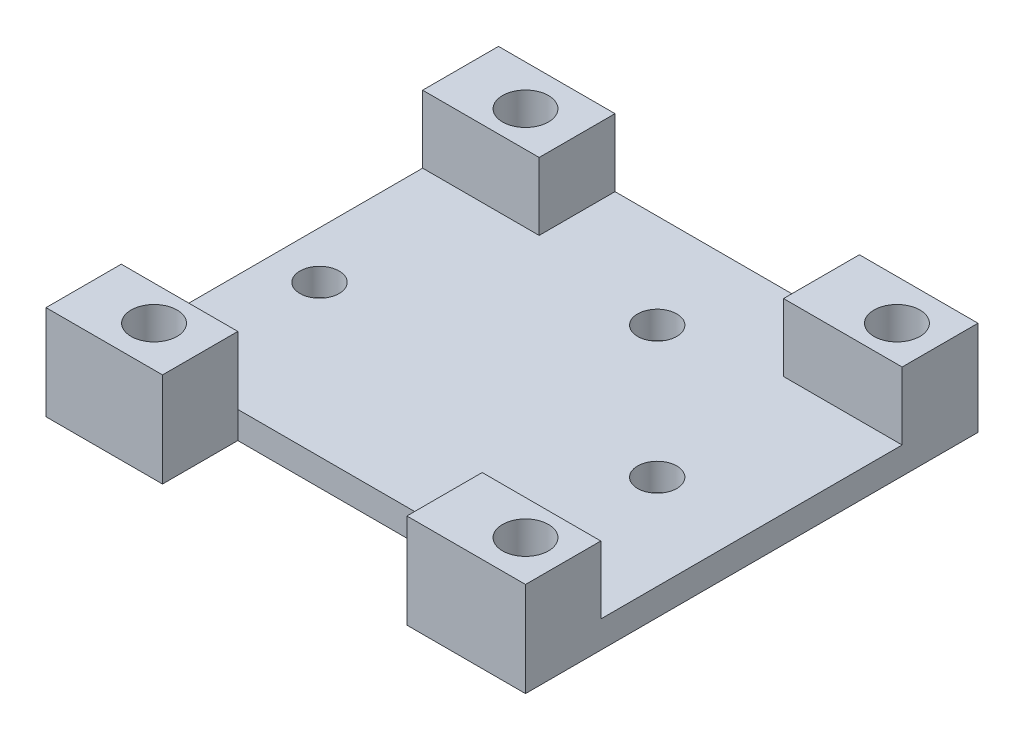
ISO-10303-21;
HEADER;
FILE_DESCRIPTION(('STEP AP214'),'2;1');
FILE_NAME('part.step','',(''),(''),'','','');
FILE_SCHEMA(('AUTOMOTIVE_DESIGN { 1 0 10303 214 1 1 1 1 }'));
ENDSEC;
DATA;
#1=APPLICATION_CONTEXT('core data for automotive mechanical design processes');
#2=APPLICATION_PROTOCOL_DEFINITION('international standard','automotive_design',2000,#1);
#3=PRODUCT_CONTEXT('',#1,'mechanical');
#4=PRODUCT('Part','Part','',(#3));
#5=PRODUCT_RELATED_PRODUCT_CATEGORY('part','',(#4));
#6=PRODUCT_DEFINITION_FORMATION('','',#4);
#7=PRODUCT_DEFINITION_CONTEXT('part definition',#1,'design');
#8=PRODUCT_DEFINITION('design','',#6,#7);
#9=PRODUCT_DEFINITION_SHAPE('','',#8);
#10=(LENGTH_UNIT() NAMED_UNIT(*) SI_UNIT(.MILLI.,.METRE.));
#11=(NAMED_UNIT(*) PLANE_ANGLE_UNIT() SI_UNIT($,.RADIAN.));
#12=(NAMED_UNIT(*) SI_UNIT($,.STERADIAN.) SOLID_ANGLE_UNIT());
#13=UNCERTAINTY_MEASURE_WITH_UNIT(LENGTH_MEASURE(1.E-05),#10,'distance_accuracy_value','');
#14=(GEOMETRIC_REPRESENTATION_CONTEXT(3) GLOBAL_UNCERTAINTY_ASSIGNED_CONTEXT((#13)) GLOBAL_UNIT_ASSIGNED_CONTEXT((#10,
#11,#12)) REPRESENTATION_CONTEXT('',''));
#15=CARTESIAN_POINT('',(0.,0.,0.));
#16=DIRECTION('',(0.,0.,1.));
#17=DIRECTION('',(1.,0.,0.));
#18=AXIS2_PLACEMENT_3D('',#15,#16,#17);
#19=CARTESIAN_POINT('',(0.,2.,0.));
#20=DIRECTION('',(0.,1.,0.));
#21=DIRECTION('',(0.,0.,1.));
#22=AXIS2_PLACEMENT_3D('',#19,#20,#21);
#23=PLANE('',#22);
#24=DIRECTION('',(0.,0.,-1.));
#25=VECTOR('',#24,1.);
#26=CARTESIAN_POINT('',(-15.5,2.,0.));
#27=LINE('',#26,#25);
#28=CARTESIAN_POINT('',(-15.5,2.,11.1762712747934));
#29=VERTEX_POINT('',#28);
#30=CARTESIAN_POINT('',(-15.5,2.,-11.1332856160443));
#31=VERTEX_POINT('',#30);
#32=EDGE_CURVE('E351',#29,#31,#27,.T.);
#33=ORIENTED_EDGE('',*,*,#32,.F.);
#34=DIRECTION('',(1.,0.,0.));
#35=VECTOR('',#34,1.);
#36=CARTESIAN_POINT('',(-20.,2.,11.1762712747934));
#37=LINE('',#36,#35);
#38=CARTESIAN_POINT('',(-6.87255590859099,2.,11.1762712747934));
#39=VERTEX_POINT('',#38);
#40=EDGE_CURVE('E205',#29,#39,#37,.T.);
#41=ORIENTED_EDGE('',*,*,#40,.T.);
#42=CARTESIAN_POINT('',(11.2192569335427,2.,11.1762712747934));
#43=VERTEX_POINT('',#42);
#44=EDGE_CURVE('E193',#39,#43,#37,.T.);
#45=ORIENTED_EDGE('',*,*,#44,.T.);
#46=CARTESIAN_POINT('',(20.,2.,11.1762712747934));
#47=VERTEX_POINT('',#46);
#48=EDGE_CURVE('E202',#43,#47,#37,.T.);
#49=ORIENTED_EDGE('',*,*,#48,.T.);
#50=DIRECTION('',(0.,0.,-1.));
#51=VECTOR('',#50,1.);
#52=CARTESIAN_POINT('',(20.,2.,-11.1332856160443));
#53=LINE('',#52,#51);
#54=CARTESIAN_POINT('',(20.,2.,-11.1332856160443));
#55=VERTEX_POINT('',#54);
#56=EDGE_CURVE('E257',#47,#55,#53,.T.);
#57=ORIENTED_EDGE('',*,*,#56,.T.);
#58=DIRECTION('',(-1.,0.,0.));
#59=VECTOR('',#58,1.);
#60=CARTESIAN_POINT('',(11.2192569335427,2.,-11.1332856160443));
#61=LINE('',#60,#59);
#62=CARTESIAN_POINT('',(11.2192569335427,2.,-11.1332856160443));
#63=VERTEX_POINT('',#62);
#64=EDGE_CURVE('E260',#55,#63,#61,.T.);
#65=ORIENTED_EDGE('',*,*,#64,.T.);
#66=DIRECTION('',(0.,0.,-1.));
#67=VECTOR('',#66,1.);
#68=CARTESIAN_POINT('',(11.2192569335427,2.,-16.75));
#69=LINE('',#68,#67);
#70=CARTESIAN_POINT('',(11.2192569335427,2.,-16.75));
#71=VERTEX_POINT('',#70);
#72=EDGE_CURVE('E207',#63,#71,#69,.T.);
#73=ORIENTED_EDGE('',*,*,#72,.T.);
#74=DIRECTION('',(-1.,0.,0.));
#75=VECTOR('',#74,1.);
#76=CARTESIAN_POINT('',(-20.,2.,-16.75));
#77=LINE('',#76,#75);
#78=CARTESIAN_POINT('',(-6.87255590859099,2.,-16.75));
#79=VERTEX_POINT('',#78);
#80=EDGE_CURVE('E214',#71,#79,#77,.T.);
#81=ORIENTED_EDGE('',*,*,#80,.T.);
#82=DIRECTION('',(0.,0.,-1.));
#83=VECTOR('',#82,1.);
#84=CARTESIAN_POINT('',(-6.87255590859099,2.,-16.75));
#85=LINE('',#84,#83);
#86=CARTESIAN_POINT('',(-6.87255590859099,2.,-11.1332856160443));
#87=VERTEX_POINT('',#86);
#88=EDGE_CURVE('E327',#87,#79,#85,.T.);
#89=ORIENTED_EDGE('',*,*,#88,.F.);
#90=DIRECTION('',(1.,0.,0.));
#91=VECTOR('',#90,1.);
#92=CARTESIAN_POINT('',(-6.87255590859099,2.,-11.1332856160443));
#93=LINE('',#92,#91);
#94=EDGE_CURVE('E324',#31,#87,#93,.T.);
#95=ORIENTED_EDGE('',*,*,#94,.F.);
#96=EDGE_LOOP('',(#33,#41,#45,#49,#57,#65,#73,#81,#89,#95));
#97=FACE_BOUND('',#96,.T.);
#98=CARTESIAN_POINT('',(3.25,2.,-9.75000000000001));
#99=DIRECTION('',(0.,1.,0.));
#100=DIRECTION('',(0.,0.,1.));
#101=AXIS2_PLACEMENT_3D('',#98,#99,#100);
#102=CIRCLE('',#101,1.44999999999999);
#103=CARTESIAN_POINT('',(3.25,2.,-8.30000000000002));
#104=VERTEX_POINT('',#103);
#105=EDGE_CURVE('E269',#104,#104,#102,.T.);
#106=ORIENTED_EDGE('',*,*,#105,.F.);
#107=EDGE_LOOP('',(#106));
#108=FACE_BOUND('',#107,.T.);
#109=CARTESIAN_POINT('',(13.,2.,0.));
#110=DIRECTION('',(0.,1.,0.));
#111=DIRECTION('',(0.,0.,1.));
#112=AXIS2_PLACEMENT_3D('',#109,#110,#111);
#113=CIRCLE('',#112,1.44999999999999);
#114=CARTESIAN_POINT('',(13.,2.,1.44999999999998));
#115=VERTEX_POINT('',#114);
#116=EDGE_CURVE('E278',#115,#115,#113,.T.);
#117=ORIENTED_EDGE('',*,*,#116,.F.);
#118=EDGE_LOOP('',(#117));
#119=FACE_BOUND('',#118,.T.);
#120=CARTESIAN_POINT('',(-12.,2.,0.));
#121=DIRECTION('',(0.,1.,0.));
#122=DIRECTION('',(0.,0.,1.));
#123=AXIS2_PLACEMENT_3D('',#120,#121,#122);
#124=CIRCLE('',#123,1.44999999999999);
#125=CARTESIAN_POINT('',(-12.,2.,1.44999999999998));
#126=VERTEX_POINT('',#125);
#127=EDGE_CURVE('E284',#126,#126,#124,.T.);
#128=ORIENTED_EDGE('',*,*,#127,.F.);
#129=EDGE_LOOP('',(#128));
#130=FACE_BOUND('',#129,.T.);
#131=ADVANCED_FACE('F34',(#97,#108,#119,#130),#23,.T.);
#132=CARTESIAN_POINT('',(0.,7.,0.));
#133=DIRECTION('',(0.,1.,0.));
#134=DIRECTION('',(0.,0.,1.));
#135=AXIS2_PLACEMENT_3D('',#132,#133,#134);
#136=PLANE('',#135);
#137=DIRECTION('',(-1.,0.,0.));
#138=VECTOR('',#137,1.);
#139=CARTESIAN_POINT('',(11.2192569335427,7.,-11.1332856160443));
#140=LINE('',#139,#138);
#141=CARTESIAN_POINT('',(20.,7.,-11.1332856160443));
#142=VERTEX_POINT('',#141);
#143=CARTESIAN_POINT('',(11.2192569335427,7.,-11.1332856160443));
#144=VERTEX_POINT('',#143);
#145=EDGE_CURVE('E255',#142,#144,#140,.T.);
#146=ORIENTED_EDGE('',*,*,#145,.F.);
#147=DIRECTION('',(0.,0.,-1.));
#148=VECTOR('',#147,1.);
#149=CARTESIAN_POINT('',(20.,7.,-16.75));
#150=LINE('',#149,#148);
#151=CARTESIAN_POINT('',(20.,7.,-16.75));
#152=VERTEX_POINT('',#151);
#153=EDGE_CURVE('E175',#142,#152,#150,.T.);
#154=ORIENTED_EDGE('',*,*,#153,.T.);
#155=DIRECTION('',(-1.,0.,0.));
#156=VECTOR('',#155,1.);
#157=CARTESIAN_POINT('',(-20.,7.,-16.75));
#158=LINE('',#157,#156);
#159=CARTESIAN_POINT('',(11.2192569335427,7.,-16.75));
#160=VERTEX_POINT('',#159);
#161=EDGE_CURVE('E178',#152,#160,#158,.T.);
#162=ORIENTED_EDGE('',*,*,#161,.T.);
#163=DIRECTION('',(0.,0.,-1.));
#164=VECTOR('',#163,1.);
#165=CARTESIAN_POINT('',(11.2192569335427,7.,-16.75));
#166=LINE('',#165,#164);
#167=EDGE_CURVE('E208',#144,#160,#166,.T.);
#168=ORIENTED_EDGE('',*,*,#167,.F.);
#169=EDGE_LOOP('',(#146,#154,#162,#168));
#170=FACE_BOUND('',#169,.T.);
#171=CARTESIAN_POINT('',(17.,7.,-13.75));
#172=DIRECTION('',(0.,1.,0.));
#173=DIRECTION('',(0.,0.,1.));
#174=AXIS2_PLACEMENT_3D('',#171,#172,#173);
#175=CIRCLE('',#174,1.69999999999999);
#176=CARTESIAN_POINT('',(17.,7.,-12.05));
#177=VERTEX_POINT('',#176);
#178=EDGE_CURVE('E230',#177,#177,#175,.T.);
#179=ORIENTED_EDGE('',*,*,#178,.F.);
#180=EDGE_LOOP('',(#179));
#181=FACE_BOUND('',#180,.T.);
#182=ADVANCED_FACE('F253',(#170,#181),#136,.T.);
#183=CARTESIAN_POINT('',(20.,7.,-16.75));
#184=DIRECTION('',(-1.,0.,0.));
#185=DIRECTION('',(0.,0.,1.));
#186=AXIS2_PLACEMENT_3D('',#183,#184,#185);
#187=PLANE('',#186);
#188=ORIENTED_EDGE('',*,*,#56,.F.);
#189=DIRECTION('',(0.,-1.,0.));
#190=VECTOR('',#189,1.);
#191=CARTESIAN_POINT('',(20.,7.,11.1762712747934));
#192=LINE('',#191,#190);
#193=CARTESIAN_POINT('',(20.,7.,11.1762712747934));
#194=VERTEX_POINT('',#193);
#195=EDGE_CURVE('E300',#194,#47,#192,.T.);
#196=ORIENTED_EDGE('',*,*,#195,.F.);
#197=DIRECTION('',(0.,0.,1.));
#198=VECTOR('',#197,1.);
#199=CARTESIAN_POINT('',(20.,7.,11.1762712747934));
#200=LINE('',#199,#198);
#201=CARTESIAN_POINT('',(20.,7.,16.75));
#202=VERTEX_POINT('',#201);
#203=EDGE_CURVE('E312',#194,#202,#200,.T.);
#204=ORIENTED_EDGE('',*,*,#203,.T.);
#205=DIRECTION('',(0.,-1.,0.));
#206=VECTOR('',#205,1.);
#207=CARTESIAN_POINT('',(20.,7.,16.75));
#208=LINE('',#207,#206);
#209=CARTESIAN_POINT('',(20.,0.,16.75));
#210=VERTEX_POINT('',#209);
#211=EDGE_CURVE('E243',#202,#210,#208,.T.);
#212=ORIENTED_EDGE('',*,*,#211,.T.);
#213=DIRECTION('',(0.,0.,-1.));
#214=VECTOR('',#213,1.);
#215=CARTESIAN_POINT('',(20.,0.,-16.75));
#216=LINE('',#215,#214);
#217=CARTESIAN_POINT('',(20.,0.,-16.75));
#218=VERTEX_POINT('',#217);
#219=EDGE_CURVE('E180',#210,#218,#216,.T.);
#220=ORIENTED_EDGE('',*,*,#219,.T.);
#221=DIRECTION('',(0.,-1.,0.));
#222=VECTOR('',#221,1.);
#223=CARTESIAN_POINT('',(20.,7.,-16.75));
#224=LINE('',#223,#222);
#225=EDGE_CURVE('E184',#152,#218,#224,.T.);
#226=ORIENTED_EDGE('',*,*,#225,.F.);
#227=ORIENTED_EDGE('',*,*,#153,.F.);
#228=DIRECTION('',(0.,1.,0.));
#229=VECTOR('',#228,1.);
#230=CARTESIAN_POINT('',(20.,2.,-11.1332856160443));
#231=LINE('',#230,#229);
#232=EDGE_CURVE('E211',#55,#142,#231,.T.);
#233=ORIENTED_EDGE('',*,*,#232,.F.);
#234=EDGE_LOOP('',(#188,#196,#204,#212,#220,#226,#227,#233));
#235=FACE_BOUND('',#234,.T.);
#236=ADVANCED_FACE('F36',(#235),#187,.F.);
#237=CARTESIAN_POINT('',(-20.,7.,-16.75));
#238=DIRECTION('',(0.,0.,1.));
#239=DIRECTION('',(1.,0.,0.));
#240=AXIS2_PLACEMENT_3D('',#237,#238,#239);
#241=PLANE('',#240);
#242=DIRECTION('',(-1.,0.,0.));
#243=VECTOR('',#242,1.);
#244=CARTESIAN_POINT('',(-20.,0.,-16.75));
#245=LINE('',#244,#243);
#246=CARTESIAN_POINT('',(-15.5,0.,-16.75));
#247=VERTEX_POINT('',#246);
#248=EDGE_CURVE('E176',#218,#247,#245,.T.);
#249=ORIENTED_EDGE('',*,*,#248,.T.);
#250=DIRECTION('',(0.,1.,0.));
#251=VECTOR('',#250,1.);
#252=CARTESIAN_POINT('',(-15.5,0.,-16.75));
#253=LINE('',#252,#251);
#254=CARTESIAN_POINT('',(-15.5,7.,-16.75));
#255=VERTEX_POINT('',#254);
#256=EDGE_CURVE('E157',#247,#255,#253,.T.);
#257=ORIENTED_EDGE('',*,*,#256,.T.);
#258=DIRECTION('',(-1.,0.,0.));
#259=VECTOR('',#258,1.);
#260=CARTESIAN_POINT('',(-6.87255590859099,7.,-16.75));
#261=LINE('',#260,#259);
#262=CARTESIAN_POINT('',(-6.87255590859099,7.,-16.75));
#263=VERTEX_POINT('',#262);
#264=EDGE_CURVE('E332',#263,#255,#261,.T.);
#265=ORIENTED_EDGE('',*,*,#264,.F.);
#266=DIRECTION('',(0.,-1.,0.));
#267=VECTOR('',#266,1.);
#268=CARTESIAN_POINT('',(-6.87255590859099,7.,-16.75));
#269=LINE('',#268,#267);
#270=EDGE_CURVE('E309',#263,#79,#269,.T.);
#271=ORIENTED_EDGE('',*,*,#270,.T.);
#272=ORIENTED_EDGE('',*,*,#80,.F.);
#273=DIRECTION('',(0.,1.,0.));
#274=VECTOR('',#273,1.);
#275=CARTESIAN_POINT('',(11.2192569335427,2.,-16.75));
#276=LINE('',#275,#274);
#277=EDGE_CURVE('E217',#71,#160,#276,.T.);
#278=ORIENTED_EDGE('',*,*,#277,.T.);
#279=ORIENTED_EDGE('',*,*,#161,.F.);
#280=ORIENTED_EDGE('',*,*,#225,.T.);
#281=EDGE_LOOP('',(#249,#257,#265,#271,#272,#278,#279,#280));
#282=FACE_BOUND('',#281,.T.);
#283=ADVANCED_FACE('F247',(#282),#241,.F.);
#284=CARTESIAN_POINT('',(-20.,7.,16.75));
#285=DIRECTION('',(0.,0.,-1.));
#286=DIRECTION('',(-1.,0.,0.));
#287=AXIS2_PLACEMENT_3D('',#284,#285,#286);
#288=PLANE('',#287);
#289=DIRECTION('',(1.,0.,0.));
#290=VECTOR('',#289,1.);
#291=CARTESIAN_POINT('',(-20.,7.,16.75));
#292=LINE('',#291,#290);
#293=CARTESIAN_POINT('',(-15.5,7.,16.75));
#294=VERTEX_POINT('',#293);
#295=CARTESIAN_POINT('',(-6.87255590859099,7.,16.75));
#296=VERTEX_POINT('',#295);
#297=EDGE_CURVE('E169',#294,#296,#292,.T.);
#298=ORIENTED_EDGE('',*,*,#297,.F.);
#299=DIRECTION('',(0.,1.,0.));
#300=VECTOR('',#299,1.);
#301=CARTESIAN_POINT('',(-15.5,0.,16.75));
#302=LINE('',#301,#300);
#303=CARTESIAN_POINT('',(-15.5,0.,16.75));
#304=VERTEX_POINT('',#303);
#305=EDGE_CURVE('E154',#304,#294,#302,.T.);
#306=ORIENTED_EDGE('',*,*,#305,.F.);
#307=DIRECTION('',(1.,0.,0.));
#308=VECTOR('',#307,1.);
#309=CARTESIAN_POINT('',(-20.,0.,16.75));
#310=LINE('',#309,#308);
#311=CARTESIAN_POINT('',(-6.87255590859099,0.,16.75));
#312=VERTEX_POINT('',#311);
#313=EDGE_CURVE('E167',#304,#312,#310,.T.);
#314=ORIENTED_EDGE('',*,*,#313,.T.);
#315=DIRECTION('',(0.,1.,0.));
#316=VECTOR('',#315,1.);
#317=CARTESIAN_POINT('',(-6.87255590859099,0.,16.75));
#318=LINE('',#317,#316);
#319=EDGE_CURVE('E288',#312,#296,#318,.T.);
#320=ORIENTED_EDGE('',*,*,#319,.T.);
#321=EDGE_LOOP('',(#298,#306,#314,#320));
#322=FACE_BOUND('',#321,.T.);
#323=ADVANCED_FACE('F165',(#322),#288,.F.);
#324=DIRECTION('',(0.,0.,-1.));
#325=VECTOR('',#324,1.);
#326=CARTESIAN_POINT('',(-15.5,7.,-16.75));
#327=LINE('',#326,#325);
#328=CARTESIAN_POINT('',(-15.5,7.,11.1762712747934));
#329=VERTEX_POINT('',#328);
#330=EDGE_CURVE('E161',#294,#329,#327,.T.);
#331=ORIENTED_EDGE('',*,*,#330,.F.);
#332=ORIENTED_EDGE('',*,*,#297,.T.);
#333=DIRECTION('',(0.,0.,1.));
#334=VECTOR('',#333,1.);
#335=CARTESIAN_POINT('',(-6.87255590859099,7.,11.1762712747934));
#336=LINE('',#335,#334);
#337=CARTESIAN_POINT('',(-6.87255590859099,7.,11.1762712747934));
#338=VERTEX_POINT('',#337);
#339=EDGE_CURVE('E292',#338,#296,#336,.T.);
#340=ORIENTED_EDGE('',*,*,#339,.F.);
#341=DIRECTION('',(1.,0.,0.));
#342=VECTOR('',#341,1.);
#343=CARTESIAN_POINT('',(-20.,7.,11.1762712747934));
#344=LINE('',#343,#342);
#345=EDGE_CURVE('E218',#329,#338,#344,.T.);
#346=ORIENTED_EDGE('',*,*,#345,.F.);
#347=EDGE_LOOP('',(#331,#332,#340,#346));
#348=FACE_BOUND('',#347,.T.);
#349=CARTESIAN_POINT('',(-10.5,7.,13.75));
#350=DIRECTION('',(0.,1.,0.));
#351=DIRECTION('',(0.,0.,1.));
#352=AXIS2_PLACEMENT_3D('',#349,#350,#351);
#353=CIRCLE('',#352,1.69999999999999);
#354=CARTESIAN_POINT('',(-10.5,7.,15.45));
#355=VERTEX_POINT('',#354);
#356=EDGE_CURVE('E224',#355,#355,#353,.T.);
#357=ORIENTED_EDGE('',*,*,#356,.F.);
#358=EDGE_LOOP('',(#357));
#359=FACE_BOUND('',#358,.T.);
#360=ADVANCED_FACE('F362',(#348,#359),#136,.T.);
#361=CARTESIAN_POINT('',(0.,0.,0.));
#362=DIRECTION('',(0.,1.,0.));
#363=DIRECTION('',(0.,0.,1.));
#364=AXIS2_PLACEMENT_3D('',#361,#362,#363);
#365=PLANE('',#364);
#366=CARTESIAN_POINT('',(-10.5,0.,-13.75));
#367=DIRECTION('',(0.,1.,0.));
#368=DIRECTION('',(0.,0.,1.));
#369=AXIS2_PLACEMENT_3D('',#366,#367,#368);
#370=CIRCLE('',#369,1.69999999999999);
#371=CARTESIAN_POINT('',(-10.5,0.,-12.05));
#372=VERTEX_POINT('',#371);
#373=EDGE_CURVE('E342',#372,#372,#370,.T.);
#374=ORIENTED_EDGE('',*,*,#373,.T.);
#375=EDGE_LOOP('',(#374));
#376=FACE_BOUND('',#375,.T.);
#377=CARTESIAN_POINT('',(17.,0.,13.75));
#378=DIRECTION('',(0.,1.,0.));
#379=DIRECTION('',(0.,0.,1.));
#380=AXIS2_PLACEMENT_3D('',#377,#378,#379);
#381=CIRCLE('',#380,1.69999999999999);
#382=CARTESIAN_POINT('',(17.,0.,15.45));
#383=VERTEX_POINT('',#382);
#384=EDGE_CURVE('E330',#383,#383,#381,.T.);
#385=ORIENTED_EDGE('',*,*,#384,.T.);
#386=EDGE_LOOP('',(#385));
#387=FACE_BOUND('',#386,.T.);
#388=CARTESIAN_POINT('',(-12.,0.,0.));
#389=DIRECTION('',(0.,1.,0.));
#390=DIRECTION('',(0.,0.,1.));
#391=AXIS2_PLACEMENT_3D('',#388,#389,#390);
#392=CIRCLE('',#391,1.45);
#393=CARTESIAN_POINT('',(-12.,0.,1.44999999999999));
#394=VERTEX_POINT('',#393);
#395=EDGE_CURVE('E281',#394,#394,#392,.T.);
#396=ORIENTED_EDGE('',*,*,#395,.T.);
#397=EDGE_LOOP('',(#396));
#398=FACE_BOUND('',#397,.T.);
#399=CARTESIAN_POINT('',(13.,0.,0.));
#400=DIRECTION('',(0.,1.,0.));
#401=DIRECTION('',(0.,0.,1.));
#402=AXIS2_PLACEMENT_3D('',#399,#400,#401);
#403=CIRCLE('',#402,1.45);
#404=CARTESIAN_POINT('',(13.,0.,1.44999999999999));
#405=VERTEX_POINT('',#404);
#406=EDGE_CURVE('E273',#405,#405,#403,.T.);
#407=ORIENTED_EDGE('',*,*,#406,.T.);
#408=EDGE_LOOP('',(#407));
#409=FACE_BOUND('',#408,.T.);
#410=CARTESIAN_POINT('',(3.25,0.,-9.75000000000001));
#411=DIRECTION('',(0.,1.,0.));
#412=DIRECTION('',(0.,0.,1.));
#413=AXIS2_PLACEMENT_3D('',#410,#411,#412);
#414=CIRCLE('',#413,1.45);
#415=CARTESIAN_POINT('',(3.25,0.,-8.30000000000001));
#416=VERTEX_POINT('',#415);
#417=EDGE_CURVE('E267',#416,#416,#414,.T.);
#418=ORIENTED_EDGE('',*,*,#417,.T.);
#419=EDGE_LOOP('',(#418));
#420=FACE_BOUND('',#419,.T.);
#421=CARTESIAN_POINT('',(-10.5,0.,13.75));
#422=DIRECTION('',(0.,1.,0.));
#423=DIRECTION('',(0.,0.,1.));
#424=AXIS2_PLACEMENT_3D('',#421,#422,#423);
#425=CIRCLE('',#424,1.69999999999999);
#426=CARTESIAN_POINT('',(-10.5,0.,15.45));
#427=VERTEX_POINT('',#426);
#428=EDGE_CURVE('E227',#427,#427,#425,.T.);
#429=ORIENTED_EDGE('',*,*,#428,.T.);
#430=EDGE_LOOP('',(#429));
#431=FACE_BOUND('',#430,.T.);
#432=CARTESIAN_POINT('',(17.,0.,-13.75));
#433=DIRECTION('',(0.,1.,0.));
#434=DIRECTION('',(0.,0.,1.));
#435=AXIS2_PLACEMENT_3D('',#432,#433,#434);
#436=CIRCLE('',#435,1.7);
#437=CARTESIAN_POINT('',(17.,0.,-12.05));
#438=VERTEX_POINT('',#437);
#439=EDGE_CURVE('E233',#438,#438,#436,.T.);
#440=ORIENTED_EDGE('',*,*,#439,.T.);
#441=EDGE_LOOP('',(#440));
#442=FACE_BOUND('',#441,.T.);
#443=ORIENTED_EDGE('',*,*,#313,.F.);
#444=DIRECTION('',(0.,0.,-1.));
#445=VECTOR('',#444,1.);
#446=CARTESIAN_POINT('',(-15.5,0.,-16.75));
#447=LINE('',#446,#445);
#448=EDGE_CURVE('E151',#304,#247,#447,.T.);
#449=ORIENTED_EDGE('',*,*,#448,.T.);
#450=ORIENTED_EDGE('',*,*,#248,.F.);
#451=ORIENTED_EDGE('',*,*,#219,.F.);
#452=DIRECTION('',(-1.,0.,0.));
#453=VECTOR('',#452,1.);
#454=CARTESIAN_POINT('',(11.2192569335427,0.,16.75));
#455=LINE('',#454,#453);
#456=CARTESIAN_POINT('',(11.2192569335427,0.,16.75));
#457=VERTEX_POINT('',#456);
#458=EDGE_CURVE('E305',#210,#457,#455,.T.);
#459=ORIENTED_EDGE('',*,*,#458,.T.);
#460=DIRECTION('',(0.,0.,-1.));
#461=VECTOR('',#460,1.);
#462=CARTESIAN_POINT('',(11.2192569335427,0.,11.1762712747934));
#463=LINE('',#462,#461);
#464=CARTESIAN_POINT('',(11.2192569335427,0.,11.1762712747934));
#465=VERTEX_POINT('',#464);
#466=EDGE_CURVE('E56',#457,#465,#463,.T.);
#467=ORIENTED_EDGE('',*,*,#466,.T.);
#468=DIRECTION('',(-1.,0.,0.));
#469=VECTOR('',#468,1.);
#470=CARTESIAN_POINT('',(-6.87255590859099,0.,11.1762712747934));
#471=LINE('',#470,#469);
#472=CARTESIAN_POINT('',(-6.87255590859099,0.,11.1762712747934));
#473=VERTEX_POINT('',#472);
#474=EDGE_CURVE('E195',#465,#473,#471,.T.);
#475=ORIENTED_EDGE('',*,*,#474,.T.);
#476=DIRECTION('',(0.,0.,1.));
#477=VECTOR('',#476,1.);
#478=CARTESIAN_POINT('',(-6.87255590859099,0.,11.1762712747934));
#479=LINE('',#478,#477);
#480=EDGE_CURVE('E174',#473,#312,#479,.T.);
#481=ORIENTED_EDGE('',*,*,#480,.T.);
#482=EDGE_LOOP('',(#443,#449,#450,#451,#459,#467,#475,#481));
#483=FACE_BOUND('',#482,.T.);
#484=ADVANCED_FACE('F172',(#376,#387,#398,#409,#420,#431,#442,#483),#365,.F.);
#485=CARTESIAN_POINT('',(17.,7.,-13.75));
#486=DIRECTION('',(0.,1.,0.));
#487=DIRECTION('',(0.,0.,1.));
#488=AXIS2_PLACEMENT_3D('',#485,#486,#487);
#489=CYLINDRICAL_SURFACE('',#488,1.69999999999999);
#490=ORIENTED_EDGE('',*,*,#439,.F.);
#491=EDGE_LOOP('',(#490));
#492=FACE_BOUND('',#491,.T.);
#493=ORIENTED_EDGE('',*,*,#178,.T.);
#494=EDGE_LOOP('',(#493));
#495=FACE_BOUND('',#494,.T.);
#496=ADVANCED_FACE('F397',(#492,#495),#489,.F.);
#497=CARTESIAN_POINT('',(-10.5,7.,13.75));
#498=DIRECTION('',(0.,1.,0.));
#499=DIRECTION('',(0.,0.,1.));
#500=AXIS2_PLACEMENT_3D('',#497,#498,#499);
#501=CYLINDRICAL_SURFACE('',#500,1.69999999999999);
#502=ORIENTED_EDGE('',*,*,#428,.F.);
#503=EDGE_LOOP('',(#502));
#504=FACE_BOUND('',#503,.T.);
#505=ORIENTED_EDGE('',*,*,#356,.T.);
#506=EDGE_LOOP('',(#505));
#507=FACE_BOUND('',#506,.T.);
#508=ADVANCED_FACE('F391',(#504,#507),#501,.F.);
#509=CARTESIAN_POINT('',(11.2192569335427,2.,-16.75));
#510=DIRECTION('',(1.,0.,0.));
#511=DIRECTION('',(0.,0.,-1.));
#512=AXIS2_PLACEMENT_3D('',#509,#510,#511);
#513=PLANE('',#512);
#514=ORIENTED_EDGE('',*,*,#72,.F.);
#515=DIRECTION('',(0.,1.,0.));
#516=VECTOR('',#515,1.);
#517=CARTESIAN_POINT('',(11.2192569335427,2.,-11.1332856160443));
#518=LINE('',#517,#516);
#519=EDGE_CURVE('E220',#63,#144,#518,.T.);
#520=ORIENTED_EDGE('',*,*,#519,.T.);
#521=ORIENTED_EDGE('',*,*,#167,.T.);
#522=ORIENTED_EDGE('',*,*,#277,.F.);
#523=EDGE_LOOP('',(#514,#520,#521,#522));
#524=FACE_BOUND('',#523,.T.);
#525=ADVANCED_FACE('F388',(#524),#513,.F.);
#526=CARTESIAN_POINT('',(-20.,2.,11.1762712747934));
#527=DIRECTION('',(0.,0.,1.));
#528=DIRECTION('',(1.,0.,0.));
#529=AXIS2_PLACEMENT_3D('',#526,#527,#528);
#530=PLANE('',#529);
#531=ORIENTED_EDGE('',*,*,#40,.F.);
#532=DIRECTION('',(0.,1.,0.));
#533=VECTOR('',#532,1.);
#534=CARTESIAN_POINT('',(-15.5,2.,11.1762712747934));
#535=LINE('',#534,#533);
#536=EDGE_CURVE('E348',#29,#329,#535,.T.);
#537=ORIENTED_EDGE('',*,*,#536,.T.);
#538=ORIENTED_EDGE('',*,*,#345,.T.);
#539=DIRECTION('',(0.,1.,0.));
#540=VECTOR('',#539,1.);
#541=CARTESIAN_POINT('',(-6.87255590859099,0.,11.1762712747934));
#542=LINE('',#541,#540);
#543=EDGE_CURVE('E290',#39,#338,#542,.T.);
#544=ORIENTED_EDGE('',*,*,#543,.F.);
#545=EDGE_LOOP('',(#531,#537,#538,#544));
#546=FACE_BOUND('',#545,.T.);
#547=ADVANCED_FACE('F358',(#546),#530,.F.);
#548=CARTESIAN_POINT('',(11.2192569335427,2.,-11.1332856160443));
#549=DIRECTION('',(0.,0.,-1.));
#550=DIRECTION('',(-1.,0.,0.));
#551=AXIS2_PLACEMENT_3D('',#548,#549,#550);
#552=PLANE('',#551);
#553=ORIENTED_EDGE('',*,*,#145,.T.);
#554=ORIENTED_EDGE('',*,*,#519,.F.);
#555=ORIENTED_EDGE('',*,*,#64,.F.);
#556=ORIENTED_EDGE('',*,*,#232,.T.);
#557=EDGE_LOOP('',(#553,#554,#555,#556));
#558=FACE_BOUND('',#557,.T.);
#559=ADVANCED_FACE('F386',(#558),#552,.F.);
#560=CARTESIAN_POINT('',(3.25,2.,-9.75000000000001));
#561=DIRECTION('',(0.,1.,0.));
#562=DIRECTION('',(0.,0.,1.));
#563=AXIS2_PLACEMENT_3D('',#560,#561,#562);
#564=CYLINDRICAL_SURFACE('',#563,1.44999999999999);
#565=ORIENTED_EDGE('',*,*,#417,.F.);
#566=EDGE_LOOP('',(#565));
#567=FACE_BOUND('',#566,.T.);
#568=ORIENTED_EDGE('',*,*,#105,.T.);
#569=EDGE_LOOP('',(#568));
#570=FACE_BOUND('',#569,.T.);
#571=ADVANCED_FACE('F440',(#567,#570),#564,.F.);
#572=CARTESIAN_POINT('',(13.,2.,0.));
#573=DIRECTION('',(0.,1.,0.));
#574=DIRECTION('',(0.,0.,1.));
#575=AXIS2_PLACEMENT_3D('',#572,#573,#574);
#576=CYLINDRICAL_SURFACE('',#575,1.44999999999999);
#577=ORIENTED_EDGE('',*,*,#406,.F.);
#578=EDGE_LOOP('',(#577));
#579=FACE_BOUND('',#578,.T.);
#580=ORIENTED_EDGE('',*,*,#116,.T.);
#581=EDGE_LOOP('',(#580));
#582=FACE_BOUND('',#581,.T.);
#583=ADVANCED_FACE('F375',(#579,#582),#576,.F.);
#584=CARTESIAN_POINT('',(-12.,2.,0.));
#585=DIRECTION('',(0.,1.,0.));
#586=DIRECTION('',(0.,0.,1.));
#587=AXIS2_PLACEMENT_3D('',#584,#585,#586);
#588=CYLINDRICAL_SURFACE('',#587,1.44999999999999);
#589=ORIENTED_EDGE('',*,*,#395,.F.);
#590=EDGE_LOOP('',(#589));
#591=FACE_BOUND('',#590,.T.);
#592=ORIENTED_EDGE('',*,*,#127,.T.);
#593=EDGE_LOOP('',(#592));
#594=FACE_BOUND('',#593,.T.);
#595=ADVANCED_FACE('F367',(#591,#594),#588,.F.);
#596=CARTESIAN_POINT('',(-6.87255590859099,0.,11.1762712747934));
#597=DIRECTION('',(-1.,0.,0.));
#598=DIRECTION('',(0.,0.,1.));
#599=AXIS2_PLACEMENT_3D('',#596,#597,#598);
#600=PLANE('',#599);
#601=ORIENTED_EDGE('',*,*,#339,.T.);
#602=ORIENTED_EDGE('',*,*,#319,.F.);
#603=ORIENTED_EDGE('',*,*,#480,.F.);
#604=EDGE_CURVE('E287',#473,#39,#542,.T.);
#605=ORIENTED_EDGE('',*,*,#604,.T.);
#606=ORIENTED_EDGE('',*,*,#543,.T.);
#607=EDGE_LOOP('',(#601,#602,#603,#605,#606));
#608=FACE_BOUND('',#607,.T.);
#609=ADVANCED_FACE('F365',(#608),#600,.F.);
#610=CARTESIAN_POINT('',(-6.87255590859099,0.,11.1762712747934));
#611=DIRECTION('',(0.,0.,-1.));
#612=DIRECTION('',(-1.,0.,0.));
#613=AXIS2_PLACEMENT_3D('',#610,#611,#612);
#614=PLANE('',#613);
#615=ORIENTED_EDGE('',*,*,#474,.F.);
#616=DIRECTION('',(0.,1.,0.));
#617=VECTOR('',#616,1.);
#618=CARTESIAN_POINT('',(11.2192569335427,0.,11.1762712747934));
#619=LINE('',#618,#617);
#620=EDGE_CURVE('E42',#465,#43,#619,.T.);
#621=ORIENTED_EDGE('',*,*,#620,.T.);
#622=ORIENTED_EDGE('',*,*,#44,.F.);
#623=ORIENTED_EDGE('',*,*,#604,.F.);
#624=EDGE_LOOP('',(#615,#621,#622,#623));
#625=FACE_BOUND('',#624,.T.);
#626=ADVANCED_FACE('F191',(#625),#614,.F.);
#627=CARTESIAN_POINT('',(11.2192569335427,7.,11.1762712747934));
#628=DIRECTION('',(-1.,0.,0.));
#629=DIRECTION('',(0.,0.,1.));
#630=AXIS2_PLACEMENT_3D('',#627,#628,#629);
#631=PLANE('',#630);
#632=ORIENTED_EDGE('',*,*,#466,.F.);
#633=DIRECTION('',(0.,-1.,0.));
#634=VECTOR('',#633,1.);
#635=CARTESIAN_POINT('',(11.2192569335427,7.,16.75));
#636=LINE('',#635,#634);
#637=CARTESIAN_POINT('',(11.2192569335427,7.,16.75));
#638=VERTEX_POINT('',#637);
#639=EDGE_CURVE('E295',#638,#457,#636,.T.);
#640=ORIENTED_EDGE('',*,*,#639,.F.);
#641=DIRECTION('',(0.,0.,-1.));
#642=VECTOR('',#641,1.);
#643=CARTESIAN_POINT('',(11.2192569335427,7.,11.1762712747934));
#644=LINE('',#643,#642);
#645=CARTESIAN_POINT('',(11.2192569335427,7.,11.1762712747934));
#646=VERTEX_POINT('',#645);
#647=EDGE_CURVE('E307',#638,#646,#644,.T.);
#648=ORIENTED_EDGE('',*,*,#647,.T.);
#649=DIRECTION('',(0.,-1.,0.));
#650=VECTOR('',#649,1.);
#651=CARTESIAN_POINT('',(11.2192569335427,7.,11.1762712747934));
#652=LINE('',#651,#650);
#653=EDGE_CURVE('E298',#646,#43,#652,.T.);
#654=ORIENTED_EDGE('',*,*,#653,.T.);
#655=ORIENTED_EDGE('',*,*,#620,.F.);
#656=EDGE_LOOP('',(#632,#640,#648,#654,#655));
#657=FACE_BOUND('',#656,.T.);
#658=ADVANCED_FACE('F373',(#657),#631,.T.);
#659=CARTESIAN_POINT('',(11.2192569335427,7.,16.75));
#660=DIRECTION('',(0.,0.,1.));
#661=DIRECTION('',(1.,0.,0.));
#662=AXIS2_PLACEMENT_3D('',#659,#660,#661);
#663=PLANE('',#662);
#664=ORIENTED_EDGE('',*,*,#458,.F.);
#665=ORIENTED_EDGE('',*,*,#211,.F.);
#666=DIRECTION('',(-1.,0.,0.));
#667=VECTOR('',#666,1.);
#668=CARTESIAN_POINT('',(11.2192569335427,7.,16.75));
#669=LINE('',#668,#667);
#670=EDGE_CURVE('E301',#202,#638,#669,.T.);
#671=ORIENTED_EDGE('',*,*,#670,.T.);
#672=ORIENTED_EDGE('',*,*,#639,.T.);
#673=EDGE_LOOP('',(#664,#665,#671,#672));
#674=FACE_BOUND('',#673,.T.);
#675=ADVANCED_FACE('F498',(#674),#663,.T.);
#676=CARTESIAN_POINT('',(11.2192569335427,7.,11.1762712747934));
#677=DIRECTION('',(0.,0.,-1.));
#678=DIRECTION('',(-1.,0.,0.));
#679=AXIS2_PLACEMENT_3D('',#676,#677,#678);
#680=PLANE('',#679);
#681=ORIENTED_EDGE('',*,*,#195,.T.);
#682=ORIENTED_EDGE('',*,*,#48,.F.);
#683=ORIENTED_EDGE('',*,*,#653,.F.);
#684=DIRECTION('',(1.,0.,0.));
#685=VECTOR('',#684,1.);
#686=CARTESIAN_POINT('',(11.2192569335427,7.,11.1762712747934));
#687=LINE('',#686,#685);
#688=EDGE_CURVE('E314',#646,#194,#687,.T.);
#689=ORIENTED_EDGE('',*,*,#688,.T.);
#690=EDGE_LOOP('',(#681,#682,#683,#689));
#691=FACE_BOUND('',#690,.T.);
#692=ADVANCED_FACE('F506',(#691),#680,.T.);
#693=CARTESIAN_POINT('',(0.,7.,0.));
#694=DIRECTION('',(0.,1.,0.));
#695=DIRECTION('',(0.,0.,1.));
#696=AXIS2_PLACEMENT_3D('',#693,#694,#695);
#697=PLANE('',#696);
#698=CARTESIAN_POINT('',(17.,7.,13.75));
#699=DIRECTION('',(0.,1.,0.));
#700=DIRECTION('',(0.,0.,1.));
#701=AXIS2_PLACEMENT_3D('',#698,#699,#700);
#702=CIRCLE('',#701,1.69999999999999);
#703=CARTESIAN_POINT('',(17.,7.,15.45));
#704=VERTEX_POINT('',#703);
#705=EDGE_CURVE('E339',#704,#704,#702,.T.);
#706=ORIENTED_EDGE('',*,*,#705,.F.);
#707=EDGE_LOOP('',(#706));
#708=FACE_BOUND('',#707,.T.);
#709=ORIENTED_EDGE('',*,*,#647,.F.);
#710=ORIENTED_EDGE('',*,*,#670,.F.);
#711=ORIENTED_EDGE('',*,*,#203,.F.);
#712=ORIENTED_EDGE('',*,*,#688,.F.);
#713=EDGE_LOOP('',(#709,#710,#711,#712));
#714=FACE_BOUND('',#713,.T.);
#715=ADVANCED_FACE('F515',(#708,#714),#697,.T.);
#716=CARTESIAN_POINT('',(-6.87255590859099,7.,-16.75));
#717=DIRECTION('',(-1.,0.,0.));
#718=DIRECTION('',(0.,0.,1.));
#719=AXIS2_PLACEMENT_3D('',#716,#717,#718);
#720=PLANE('',#719);
#721=ORIENTED_EDGE('',*,*,#88,.T.);
#722=ORIENTED_EDGE('',*,*,#270,.F.);
#723=DIRECTION('',(0.,0.,-1.));
#724=VECTOR('',#723,1.);
#725=CARTESIAN_POINT('',(-6.87255590859099,7.,-16.75));
#726=LINE('',#725,#724);
#727=CARTESIAN_POINT('',(-6.87255590859099,7.,-11.1332856160443));
#728=VERTEX_POINT('',#727);
#729=EDGE_CURVE('E326',#728,#263,#726,.T.);
#730=ORIENTED_EDGE('',*,*,#729,.F.);
#731=DIRECTION('',(0.,-1.,0.));
#732=VECTOR('',#731,1.);
#733=CARTESIAN_POINT('',(-6.87255590859099,7.,-11.1332856160443));
#734=LINE('',#733,#732);
#735=EDGE_CURVE('E320',#728,#87,#734,.T.);
#736=ORIENTED_EDGE('',*,*,#735,.T.);
#737=EDGE_LOOP('',(#721,#722,#730,#736));
#738=FACE_BOUND('',#737,.T.);
#739=ADVANCED_FACE('F525',(#738),#720,.F.);
#740=CARTESIAN_POINT('',(-6.87255590859099,7.,-11.1332856160443));
#741=DIRECTION('',(0.,0.,-1.));
#742=DIRECTION('',(-1.,0.,0.));
#743=AXIS2_PLACEMENT_3D('',#740,#741,#742);
#744=PLANE('',#743);
#745=DIRECTION('',(1.,0.,0.));
#746=VECTOR('',#745,1.);
#747=CARTESIAN_POINT('',(-6.87255590859099,7.,-11.1332856160443));
#748=LINE('',#747,#746);
#749=CARTESIAN_POINT('',(-15.5,7.,-11.1332856160443));
#750=VERTEX_POINT('',#749);
#751=EDGE_CURVE('E323',#750,#728,#748,.T.);
#752=ORIENTED_EDGE('',*,*,#751,.F.);
#753=DIRECTION('',(0.,-1.,0.));
#754=VECTOR('',#753,1.);
#755=CARTESIAN_POINT('',(-15.5,7.,-11.1332856160443));
#756=LINE('',#755,#754);
#757=EDGE_CURVE('E49',#750,#31,#756,.T.);
#758=ORIENTED_EDGE('',*,*,#757,.T.);
#759=ORIENTED_EDGE('',*,*,#94,.T.);
#760=ORIENTED_EDGE('',*,*,#735,.F.);
#761=EDGE_LOOP('',(#752,#758,#759,#760));
#762=FACE_BOUND('',#761,.T.);
#763=ADVANCED_FACE('F550',(#762),#744,.F.);
#764=CARTESIAN_POINT('',(0.,7.,0.));
#765=DIRECTION('',(0.,-1.,0.));
#766=DIRECTION('',(0.,0.,-1.));
#767=AXIS2_PLACEMENT_3D('',#764,#765,#766);
#768=PLANE('',#767);
#769=CARTESIAN_POINT('',(-10.5,7.,-13.75));
#770=DIRECTION('',(0.,1.,0.));
#771=DIRECTION('',(0.,0.,1.));
#772=AXIS2_PLACEMENT_3D('',#769,#770,#771);
#773=CIRCLE('',#772,1.69999999999999);
#774=CARTESIAN_POINT('',(-10.5,7.,-12.05));
#775=VERTEX_POINT('',#774);
#776=EDGE_CURVE('E345',#775,#775,#773,.T.);
#777=ORIENTED_EDGE('',*,*,#776,.F.);
#778=EDGE_LOOP('',(#777));
#779=FACE_BOUND('',#778,.T.);
#780=ORIENTED_EDGE('',*,*,#264,.T.);
#781=DIRECTION('',(0.,0.,1.));
#782=VECTOR('',#781,1.);
#783=CARTESIAN_POINT('',(-15.5,7.,0.));
#784=LINE('',#783,#782);
#785=EDGE_CURVE('E11',#255,#750,#784,.T.);
#786=ORIENTED_EDGE('',*,*,#785,.T.);
#787=ORIENTED_EDGE('',*,*,#751,.T.);
#788=ORIENTED_EDGE('',*,*,#729,.T.);
#789=EDGE_LOOP('',(#780,#786,#787,#788));
#790=FACE_BOUND('',#789,.T.);
#791=ADVANCED_FACE('F559',(#779,#790),#768,.F.);
#792=CARTESIAN_POINT('',(17.,7.,13.75));
#793=DIRECTION('',(0.,1.,0.));
#794=DIRECTION('',(0.,0.,1.));
#795=AXIS2_PLACEMENT_3D('',#792,#793,#794);
#796=CYLINDRICAL_SURFACE('',#795,1.69999999999999);
#797=ORIENTED_EDGE('',*,*,#384,.F.);
#798=EDGE_LOOP('',(#797));
#799=FACE_BOUND('',#798,.T.);
#800=ORIENTED_EDGE('',*,*,#705,.T.);
#801=EDGE_LOOP('',(#800));
#802=FACE_BOUND('',#801,.T.);
#803=ADVANCED_FACE('F568',(#799,#802),#796,.F.);
#804=CARTESIAN_POINT('',(-10.5,7.,-13.75));
#805=DIRECTION('',(0.,1.,0.));
#806=DIRECTION('',(0.,0.,1.));
#807=AXIS2_PLACEMENT_3D('',#804,#805,#806);
#808=CYLINDRICAL_SURFACE('',#807,1.69999999999999);
#809=ORIENTED_EDGE('',*,*,#373,.F.);
#810=EDGE_LOOP('',(#809));
#811=FACE_BOUND('',#810,.T.);
#812=ORIENTED_EDGE('',*,*,#776,.T.);
#813=EDGE_LOOP('',(#812));
#814=FACE_BOUND('',#813,.T.);
#815=ADVANCED_FACE('F577',(#811,#814),#808,.F.);
#816=CARTESIAN_POINT('',(-15.5,0.,-16.75));
#817=DIRECTION('',(1.,0.,0.));
#818=DIRECTION('',(0.,0.,-1.));
#819=AXIS2_PLACEMENT_3D('',#816,#817,#818);
#820=PLANE('',#819);
#821=ORIENTED_EDGE('',*,*,#32,.T.);
#822=ORIENTED_EDGE('',*,*,#757,.F.);
#823=ORIENTED_EDGE('',*,*,#785,.F.);
#824=ORIENTED_EDGE('',*,*,#256,.F.);
#825=ORIENTED_EDGE('',*,*,#448,.F.);
#826=ORIENTED_EDGE('',*,*,#305,.T.);
#827=ORIENTED_EDGE('',*,*,#330,.T.);
#828=ORIENTED_EDGE('',*,*,#536,.F.);
#829=EDGE_LOOP('',(#821,#822,#823,#824,#825,#826,#827,#828));
#830=FACE_BOUND('',#829,.T.);
#831=ADVANCED_FACE('F153',(#830),#820,.F.);
#832=CLOSED_SHELL('',(#131,#182,#236,#283,#323,#360,#484,#496,#508,#525,#547,#559,#571,#583,
#595,#609,#626,#658,#675,#692,#715,#739,#763,#791,#803,#815,#831));
#833=MANIFOLD_SOLID_BREP('B2',#832);
#834=ADVANCED_BREP_SHAPE_REPRESENTATION('',(#18,#833),#14);
#835=SHAPE_DEFINITION_REPRESENTATION(#9,#834);
ENDSEC;
END-ISO-10303-21;
